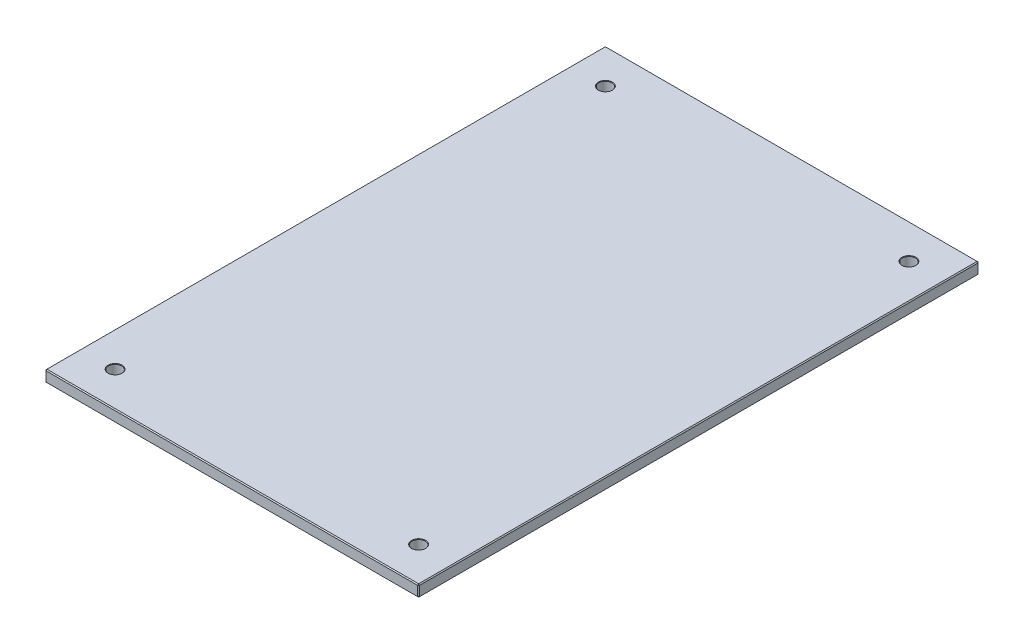
ISO-10303-21;
HEADER;
FILE_DESCRIPTION(('STEP AP214'),'2;1');
FILE_NAME('part.step','',(''),(''),'','','');
FILE_SCHEMA(('AUTOMOTIVE_DESIGN { 1 0 10303 214 1 1 1 1 }'));
ENDSEC;
DATA;
#1=APPLICATION_CONTEXT('core data for automotive mechanical design processes');
#2=APPLICATION_PROTOCOL_DEFINITION('international standard','automotive_design',2000,#1);
#3=PRODUCT_CONTEXT('',#1,'mechanical');
#4=PRODUCT('Part','Part','',(#3));
#5=PRODUCT_RELATED_PRODUCT_CATEGORY('part','',(#4));
#6=PRODUCT_DEFINITION_FORMATION('','',#4);
#7=PRODUCT_DEFINITION_CONTEXT('part definition',#1,'design');
#8=PRODUCT_DEFINITION('design','',#6,#7);
#9=PRODUCT_DEFINITION_SHAPE('','',#8);
#10=(LENGTH_UNIT() NAMED_UNIT(*) SI_UNIT(.MILLI.,.METRE.));
#11=(NAMED_UNIT(*) PLANE_ANGLE_UNIT() SI_UNIT($,.RADIAN.));
#12=(NAMED_UNIT(*) SI_UNIT($,.STERADIAN.) SOLID_ANGLE_UNIT());
#13=UNCERTAINTY_MEASURE_WITH_UNIT(LENGTH_MEASURE(1.E-05),#10,'distance_accuracy_value','');
#14=(GEOMETRIC_REPRESENTATION_CONTEXT(3) GLOBAL_UNCERTAINTY_ASSIGNED_CONTEXT((#13)) GLOBAL_UNIT_ASSIGNED_CONTEXT((#10,
#11,#12)) REPRESENTATION_CONTEXT('',''));
#15=CARTESIAN_POINT('',(0.,0.,0.));
#16=DIRECTION('',(0.,0.,1.));
#17=DIRECTION('',(1.,0.,0.));
#18=AXIS2_PLACEMENT_3D('',#15,#16,#17);
#19=CARTESIAN_POINT('',(101.6,3.175,152.4));
#20=DIRECTION('',(-1.,0.,0.));
#21=DIRECTION('',(0.,0.,1.));
#22=AXIS2_PLACEMENT_3D('',#19,#20,#21);
#23=PLANE('',#22);
#24=DIRECTION('',(0.,0.,-1.));
#25=VECTOR('',#24,1.);
#26=CARTESIAN_POINT('',(101.6,-2.66699999999999,-152.4));
#27=LINE('',#26,#25);
#28=CARTESIAN_POINT('',(101.6,-2.66699999999999,151.892));
#29=VERTEX_POINT('',#28);
#30=CARTESIAN_POINT('',(101.6,-2.66699999999999,-151.892));
#31=VERTEX_POINT('',#30);
#32=EDGE_CURVE('E183',#29,#31,#27,.T.);
#33=ORIENTED_EDGE('',*,*,#32,.T.);
#34=DIRECTION('',(0.,1.,0.));
#35=VECTOR('',#34,1.);
#36=CARTESIAN_POINT('',(101.6,3.175,-151.892));
#37=LINE('',#36,#35);
#38=CARTESIAN_POINT('',(101.6,2.66699999999999,-151.892));
#39=VERTEX_POINT('',#38);
#40=EDGE_CURVE('E188',#31,#39,#37,.T.);
#41=ORIENTED_EDGE('',*,*,#40,.T.);
#42=DIRECTION('',(0.,0.,1.));
#43=VECTOR('',#42,1.);
#44=CARTESIAN_POINT('',(101.6,2.66699999999999,152.4));
#45=LINE('',#44,#43);
#46=CARTESIAN_POINT('',(101.6,2.66699999999999,151.892));
#47=VERTEX_POINT('',#46);
#48=EDGE_CURVE('E185',#39,#47,#45,.T.);
#49=ORIENTED_EDGE('',*,*,#48,.T.);
#50=DIRECTION('',(0.,-1.,0.));
#51=VECTOR('',#50,1.);
#52=CARTESIAN_POINT('',(101.6,3.175,151.892));
#53=LINE('',#52,#51);
#54=EDGE_CURVE('E181',#47,#29,#53,.T.);
#55=ORIENTED_EDGE('',*,*,#54,.T.);
#56=EDGE_LOOP('',(#33,#41,#49,#55));
#57=FACE_BOUND('',#56,.T.);
#58=ADVANCED_FACE('F46',(#57),#23,.F.);
#59=CARTESIAN_POINT('',(-101.6,3.175,-152.4));
#60=DIRECTION('',(0.,0.,1.));
#61=DIRECTION('',(1.,0.,0.));
#62=AXIS2_PLACEMENT_3D('',#59,#60,#61);
#63=PLANE('',#62);
#64=DIRECTION('',(1.,0.,0.));
#65=VECTOR('',#64,1.);
#66=CARTESIAN_POINT('',(-101.6,2.66699999999999,-152.4));
#67=LINE('',#66,#65);
#68=CARTESIAN_POINT('',(-101.092,2.66699999999999,-152.4));
#69=VERTEX_POINT('',#68);
#70=CARTESIAN_POINT('',(101.092,2.66699999999999,-152.4));
#71=VERTEX_POINT('',#70);
#72=EDGE_CURVE('E203',#69,#71,#67,.T.);
#73=ORIENTED_EDGE('',*,*,#72,.T.);
#74=DIRECTION('',(0.,-1.,0.));
#75=VECTOR('',#74,1.);
#76=CARTESIAN_POINT('',(101.092,3.175,-152.4));
#77=LINE('',#76,#75);
#78=CARTESIAN_POINT('',(101.092,-2.66699999999999,-152.4));
#79=VERTEX_POINT('',#78);
#80=EDGE_CURVE('E205',#71,#79,#77,.T.);
#81=ORIENTED_EDGE('',*,*,#80,.T.);
#82=DIRECTION('',(-1.,0.,0.));
#83=VECTOR('',#82,1.);
#84=CARTESIAN_POINT('',(-101.6,-2.66699999999999,-152.4));
#85=LINE('',#84,#83);
#86=CARTESIAN_POINT('',(-101.092,-2.66699999999999,-152.4));
#87=VERTEX_POINT('',#86);
#88=EDGE_CURVE('E201',#79,#87,#85,.T.);
#89=ORIENTED_EDGE('',*,*,#88,.T.);
#90=DIRECTION('',(0.,1.,0.));
#91=VECTOR('',#90,1.);
#92=CARTESIAN_POINT('',(-101.092,3.175,-152.4));
#93=LINE('',#92,#91);
#94=EDGE_CURVE('E199',#87,#69,#93,.T.);
#95=ORIENTED_EDGE('',*,*,#94,.T.);
#96=EDGE_LOOP('',(#73,#81,#89,#95));
#97=FACE_BOUND('',#96,.T.);
#98=ADVANCED_FACE('F349',(#97),#63,.F.);
#99=CARTESIAN_POINT('',(-101.6,3.175,152.4));
#100=DIRECTION('',(1.,0.,0.));
#101=DIRECTION('',(0.,0.,-1.));
#102=AXIS2_PLACEMENT_3D('',#99,#100,#101);
#103=PLANE('',#102);
#104=DIRECTION('',(0.,0.,-1.));
#105=VECTOR('',#104,1.);
#106=CARTESIAN_POINT('',(-101.6,2.66699999999999,152.4));
#107=LINE('',#106,#105);
#108=CARTESIAN_POINT('',(-101.6,2.66699999999999,151.892));
#109=VERTEX_POINT('',#108);
#110=CARTESIAN_POINT('',(-101.6,2.66699999999999,-151.892));
#111=VERTEX_POINT('',#110);
#112=EDGE_CURVE('E153',#109,#111,#107,.T.);
#113=ORIENTED_EDGE('',*,*,#112,.T.);
#114=DIRECTION('',(0.,-1.,0.));
#115=VECTOR('',#114,1.);
#116=CARTESIAN_POINT('',(-101.6,3.175,-151.892));
#117=LINE('',#116,#115);
#118=CARTESIAN_POINT('',(-101.6,-2.66699999999999,-151.892));
#119=VERTEX_POINT('',#118);
#120=EDGE_CURVE('E213',#111,#119,#117,.T.);
#121=ORIENTED_EDGE('',*,*,#120,.T.);
#122=DIRECTION('',(0.,0.,1.));
#123=VECTOR('',#122,1.);
#124=CARTESIAN_POINT('',(-101.6,-2.66699999999999,152.4));
#125=LINE('',#124,#123);
#126=CARTESIAN_POINT('',(-101.6,-2.66699999999999,151.892));
#127=VERTEX_POINT('',#126);
#128=EDGE_CURVE('E210',#119,#127,#125,.T.);
#129=ORIENTED_EDGE('',*,*,#128,.T.);
#130=DIRECTION('',(0.,1.,0.));
#131=VECTOR('',#130,1.);
#132=CARTESIAN_POINT('',(-101.6,3.175,151.892));
#133=LINE('',#132,#131);
#134=EDGE_CURVE('E208',#127,#109,#133,.T.);
#135=ORIENTED_EDGE('',*,*,#134,.T.);
#136=EDGE_LOOP('',(#113,#121,#129,#135));
#137=FACE_BOUND('',#136,.T.);
#138=ADVANCED_FACE('F345',(#137),#103,.F.);
#139=CARTESIAN_POINT('',(-101.6,3.175,152.4));
#140=DIRECTION('',(0.,0.,-1.));
#141=DIRECTION('',(-1.,0.,0.));
#142=AXIS2_PLACEMENT_3D('',#139,#140,#141);
#143=PLANE('',#142);
#144=DIRECTION('',(-1.,0.,0.));
#145=VECTOR('',#144,1.);
#146=CARTESIAN_POINT('',(-101.6,2.66699999999999,152.4));
#147=LINE('',#146,#145);
#148=CARTESIAN_POINT('',(101.092,2.66699999999999,152.4));
#149=VERTEX_POINT('',#148);
#150=CARTESIAN_POINT('',(-101.092,2.66699999999999,152.4));
#151=VERTEX_POINT('',#150);
#152=EDGE_CURVE('E56',#149,#151,#147,.T.);
#153=ORIENTED_EDGE('',*,*,#152,.T.);
#154=DIRECTION('',(0.,-1.,0.));
#155=VECTOR('',#154,1.);
#156=CARTESIAN_POINT('',(-101.092,3.175,152.4));
#157=LINE('',#156,#155);
#158=CARTESIAN_POINT('',(-101.092,-2.66699999999999,152.4));
#159=VERTEX_POINT('',#158);
#160=EDGE_CURVE('E11',#151,#159,#157,.T.);
#161=ORIENTED_EDGE('',*,*,#160,.T.);
#162=DIRECTION('',(1.,0.,0.));
#163=VECTOR('',#162,1.);
#164=CARTESIAN_POINT('',(101.6,-2.66699999999999,152.4));
#165=LINE('',#164,#163);
#166=CARTESIAN_POINT('',(101.092,-2.66699999999999,152.4));
#167=VERTEX_POINT('',#166);
#168=EDGE_CURVE('E216',#159,#167,#165,.T.);
#169=ORIENTED_EDGE('',*,*,#168,.T.);
#170=DIRECTION('',(0.,1.,0.));
#171=VECTOR('',#170,1.);
#172=CARTESIAN_POINT('',(101.092,3.175,152.4));
#173=LINE('',#172,#171);
#174=EDGE_CURVE('E67',#167,#149,#173,.T.);
#175=ORIENTED_EDGE('',*,*,#174,.T.);
#176=EDGE_LOOP('',(#153,#161,#169,#175));
#177=FACE_BOUND('',#176,.T.);
#178=ADVANCED_FACE('F336',(#177),#143,.F.);
#179=CARTESIAN_POINT('',(0.,3.175,0.));
#180=DIRECTION('',(0.,-1.,0.));
#181=DIRECTION('',(0.,0.,-1.));
#182=AXIS2_PLACEMENT_3D('',#179,#180,#181);
#183=PLANE('',#182);
#184=DIRECTION('',(1.,0.,0.));
#185=VECTOR('',#184,1.);
#186=CARTESIAN_POINT('',(0.,3.175,151.892));
#187=LINE('',#186,#185);
#188=CARTESIAN_POINT('',(-101.092,3.175,151.892));
#189=VERTEX_POINT('',#188);
#190=CARTESIAN_POINT('',(101.092,3.175,151.892));
#191=VERTEX_POINT('',#190);
#192=EDGE_CURVE('E140',#189,#191,#187,.T.);
#193=ORIENTED_EDGE('',*,*,#192,.T.);
#194=DIRECTION('',(0.,0.,-1.));
#195=VECTOR('',#194,1.);
#196=CARTESIAN_POINT('',(101.092,3.175,0.));
#197=LINE('',#196,#195);
#198=CARTESIAN_POINT('',(101.092,3.175,-151.892));
#199=VERTEX_POINT('',#198);
#200=EDGE_CURVE('E179',#191,#199,#197,.T.);
#201=ORIENTED_EDGE('',*,*,#200,.T.);
#202=DIRECTION('',(-1.,0.,0.));
#203=VECTOR('',#202,1.);
#204=CARTESIAN_POINT('',(0.,3.175,-151.892));
#205=LINE('',#204,#203);
#206=CARTESIAN_POINT('',(-101.092,3.175,-151.892));
#207=VERTEX_POINT('',#206);
#208=EDGE_CURVE('E143',#199,#207,#205,.T.);
#209=ORIENTED_EDGE('',*,*,#208,.T.);
#210=DIRECTION('',(0.,0.,1.));
#211=VECTOR('',#210,1.);
#212=CARTESIAN_POINT('',(-101.092,3.175,0.));
#213=LINE('',#212,#211);
#214=EDGE_CURVE('E134',#207,#189,#213,.T.);
#215=ORIENTED_EDGE('',*,*,#214,.T.);
#216=EDGE_LOOP('',(#193,#201,#209,#215));
#217=FACE_BOUND('',#216,.T.);
#218=CARTESIAN_POINT('',(-82.55,3.175,-133.35));
#219=DIRECTION('',(0.,1.,0.));
#220=DIRECTION('',(0.,0.,1.));
#221=AXIS2_PLACEMENT_3D('',#218,#219,#220);
#222=CIRCLE('',#221,3.82523999999999);
#223=CARTESIAN_POINT('',(-82.55,3.175,-129.52476));
#224=VERTEX_POINT('',#223);
#225=EDGE_CURVE('E280',#224,#224,#222,.T.);
#226=ORIENTED_EDGE('',*,*,#225,.F.);
#227=EDGE_LOOP('',(#226));
#228=FACE_BOUND('',#227,.T.);
#229=CARTESIAN_POINT('',(82.55,3.175,-133.35));
#230=DIRECTION('',(0.,1.,0.));
#231=DIRECTION('',(0.,0.,1.));
#232=AXIS2_PLACEMENT_3D('',#229,#230,#231);
#233=CIRCLE('',#232,3.82523999999999);
#234=CARTESIAN_POINT('',(82.55,3.175,-129.52476));
#235=VERTEX_POINT('',#234);
#236=EDGE_CURVE('E296',#235,#235,#233,.T.);
#237=ORIENTED_EDGE('',*,*,#236,.F.);
#238=EDGE_LOOP('',(#237));
#239=FACE_BOUND('',#238,.T.);
#240=CARTESIAN_POINT('',(82.55,3.175,133.35));
#241=DIRECTION('',(0.,1.,0.));
#242=DIRECTION('',(0.,0.,1.));
#243=AXIS2_PLACEMENT_3D('',#240,#241,#242);
#244=CIRCLE('',#243,3.82523999999999);
#245=CARTESIAN_POINT('',(82.55,3.175,137.17524));
#246=VERTEX_POINT('',#245);
#247=EDGE_CURVE('E308',#246,#246,#244,.T.);
#248=ORIENTED_EDGE('',*,*,#247,.F.);
#249=EDGE_LOOP('',(#248));
#250=FACE_BOUND('',#249,.T.);
#251=CARTESIAN_POINT('',(-82.55,3.175,133.35));
#252=DIRECTION('',(0.,1.,0.));
#253=DIRECTION('',(0.,0.,1.));
#254=AXIS2_PLACEMENT_3D('',#251,#252,#253);
#255=CIRCLE('',#254,3.82523999999999);
#256=CARTESIAN_POINT('',(-82.55,3.175,137.17524));
#257=VERTEX_POINT('',#256);
#258=EDGE_CURVE('E320',#257,#257,#255,.T.);
#259=ORIENTED_EDGE('',*,*,#258,.F.);
#260=EDGE_LOOP('',(#259));
#261=FACE_BOUND('',#260,.T.);
#262=ADVANCED_FACE('F136',(#217,#228,#239,#250,#261),#183,.F.);
#263=CARTESIAN_POINT('',(0.,-3.175,0.));
#264=DIRECTION('',(0.,-1.,0.));
#265=DIRECTION('',(0.,0.,-1.));
#266=AXIS2_PLACEMENT_3D('',#263,#264,#265);
#267=PLANE('',#266);
#268=DIRECTION('',(1.,0.,0.));
#269=VECTOR('',#268,1.);
#270=CARTESIAN_POINT('',(101.6,-3.175,-151.892));
#271=LINE('',#270,#269);
#272=CARTESIAN_POINT('',(-101.092,-3.175,-151.892));
#273=VERTEX_POINT('',#272);
#274=CARTESIAN_POINT('',(101.092,-3.175,-151.892));
#275=VERTEX_POINT('',#274);
#276=EDGE_CURVE('E194',#273,#275,#271,.T.);
#277=ORIENTED_EDGE('',*,*,#276,.T.);
#278=DIRECTION('',(0.,0.,1.));
#279=VECTOR('',#278,1.);
#280=CARTESIAN_POINT('',(101.092,-3.175,152.4));
#281=LINE('',#280,#279);
#282=CARTESIAN_POINT('',(101.092,-3.175,151.892));
#283=VERTEX_POINT('',#282);
#284=EDGE_CURVE('E196',#275,#283,#281,.T.);
#285=ORIENTED_EDGE('',*,*,#284,.T.);
#286=DIRECTION('',(-1.,0.,0.));
#287=VECTOR('',#286,1.);
#288=CARTESIAN_POINT('',(-101.6,-3.175,151.892));
#289=LINE('',#288,#287);
#290=CARTESIAN_POINT('',(-101.092,-3.175,151.892));
#291=VERTEX_POINT('',#290);
#292=EDGE_CURVE('E190',#283,#291,#289,.T.);
#293=ORIENTED_EDGE('',*,*,#292,.T.);
#294=DIRECTION('',(0.,0.,-1.));
#295=VECTOR('',#294,1.);
#296=CARTESIAN_POINT('',(-101.092,-3.175,-152.4));
#297=LINE('',#296,#295);
#298=EDGE_CURVE('E192',#291,#273,#297,.T.);
#299=ORIENTED_EDGE('',*,*,#298,.T.);
#300=EDGE_LOOP('',(#277,#285,#293,#299));
#301=FACE_BOUND('',#300,.T.);
#302=CARTESIAN_POINT('',(-82.55,-3.175,-133.35));
#303=DIRECTION('',(0.,1.,0.));
#304=DIRECTION('',(0.,0.,1.));
#305=AXIS2_PLACEMENT_3D('',#302,#303,#304);
#306=CIRCLE('',#305,3.82523999999999);
#307=CARTESIAN_POINT('',(-82.55,-3.175,-129.52476));
#308=VERTEX_POINT('',#307);
#309=EDGE_CURVE('E274',#308,#308,#306,.T.);
#310=ORIENTED_EDGE('',*,*,#309,.T.);
#311=EDGE_LOOP('',(#310));
#312=FACE_BOUND('',#311,.T.);
#313=CARTESIAN_POINT('',(82.55,-3.175,-133.35));
#314=DIRECTION('',(0.,1.,0.));
#315=DIRECTION('',(0.,0.,1.));
#316=AXIS2_PLACEMENT_3D('',#313,#314,#315);
#317=CIRCLE('',#316,3.82523999999999);
#318=CARTESIAN_POINT('',(82.55,-3.175,-129.52476));
#319=VERTEX_POINT('',#318);
#320=EDGE_CURVE('E293',#319,#319,#317,.T.);
#321=ORIENTED_EDGE('',*,*,#320,.T.);
#322=EDGE_LOOP('',(#321));
#323=FACE_BOUND('',#322,.T.);
#324=CARTESIAN_POINT('',(82.55,-3.175,133.35));
#325=DIRECTION('',(0.,1.,0.));
#326=DIRECTION('',(0.,0.,1.));
#327=AXIS2_PLACEMENT_3D('',#324,#325,#326);
#328=CIRCLE('',#327,3.82523999999999);
#329=CARTESIAN_POINT('',(82.55,-3.175,137.17524));
#330=VERTEX_POINT('',#329);
#331=EDGE_CURVE('E305',#330,#330,#328,.T.);
#332=ORIENTED_EDGE('',*,*,#331,.T.);
#333=EDGE_LOOP('',(#332));
#334=FACE_BOUND('',#333,.T.);
#335=CARTESIAN_POINT('',(-82.55,-3.175,133.35));
#336=DIRECTION('',(0.,1.,0.));
#337=DIRECTION('',(0.,0.,1.));
#338=AXIS2_PLACEMENT_3D('',#335,#336,#337);
#339=CIRCLE('',#338,3.82523999999999);
#340=CARTESIAN_POINT('',(-82.55,-3.175,137.17524));
#341=VERTEX_POINT('',#340);
#342=EDGE_CURVE('E317',#341,#341,#339,.T.);
#343=ORIENTED_EDGE('',*,*,#342,.T.);
#344=EDGE_LOOP('',(#343));
#345=FACE_BOUND('',#344,.T.);
#346=ADVANCED_FACE('F335',(#301,#312,#323,#334,#345),#267,.T.);
#347=CARTESIAN_POINT('',(-82.55,-2.921,133.35));
#348=DIRECTION('',(0.,-1.,0.));
#349=DIRECTION('',(0.,0.,-1.));
#350=AXIS2_PLACEMENT_3D('',#347,#348,#349);
#351=CONICAL_SURFACE('',#350,3.57124,0.785398163397426);
#352=ORIENTED_EDGE('',*,*,#342,.F.);
#353=EDGE_LOOP('',(#352));
#354=FACE_BOUND('',#353,.T.);
#355=CARTESIAN_POINT('',(-82.55,-2.921,133.35));
#356=DIRECTION('',(0.,1.,0.));
#357=DIRECTION('',(0.,0.,1.));
#358=AXIS2_PLACEMENT_3D('',#355,#356,#357);
#359=CIRCLE('',#358,3.57124);
#360=CARTESIAN_POINT('',(-82.55,-2.921,136.92124));
#361=VERTEX_POINT('',#360);
#362=EDGE_CURVE('E171',#361,#361,#359,.T.);
#363=ORIENTED_EDGE('',*,*,#362,.T.);
#364=EDGE_LOOP('',(#363));
#365=FACE_BOUND('',#364,.T.);
#366=ADVANCED_FACE('F342',(#354,#365),#351,.F.);
#367=CARTESIAN_POINT('',(-82.55,3.175,133.35));
#368=DIRECTION('',(0.,1.,0.));
#369=DIRECTION('',(0.,0.,1.));
#370=AXIS2_PLACEMENT_3D('',#367,#368,#369);
#371=CYLINDRICAL_SURFACE('',#370,3.57124);
#372=ORIENTED_EDGE('',*,*,#362,.F.);
#373=EDGE_LOOP('',(#372));
#374=FACE_BOUND('',#373,.T.);
#375=CARTESIAN_POINT('',(-82.55,2.921,133.35));
#376=DIRECTION('',(0.,1.,0.));
#377=DIRECTION('',(0.,0.,1.));
#378=AXIS2_PLACEMENT_3D('',#375,#376,#377);
#379=CIRCLE('',#378,3.57124);
#380=CARTESIAN_POINT('',(-82.55,2.921,136.92124));
#381=VERTEX_POINT('',#380);
#382=EDGE_CURVE('E174',#381,#381,#379,.T.);
#383=ORIENTED_EDGE('',*,*,#382,.T.);
#384=EDGE_LOOP('',(#383));
#385=FACE_BOUND('',#384,.T.);
#386=ADVANCED_FACE('F325',(#374,#385),#371,.F.);
#387=CARTESIAN_POINT('',(-82.55,3.175,133.35));
#388=DIRECTION('',(0.,1.,0.));
#389=DIRECTION('',(0.,0.,1.));
#390=AXIS2_PLACEMENT_3D('',#387,#388,#389);
#391=CONICAL_SURFACE('',#390,3.82523999999999,0.785398163397428);
#392=ORIENTED_EDGE('',*,*,#382,.F.);
#393=EDGE_LOOP('',(#392));
#394=FACE_BOUND('',#393,.T.);
#395=ORIENTED_EDGE('',*,*,#258,.T.);
#396=EDGE_LOOP('',(#395));
#397=FACE_BOUND('',#396,.T.);
#398=ADVANCED_FACE('F327',(#394,#397),#391,.F.);
#399=CARTESIAN_POINT('',(82.55,-2.921,133.35));
#400=DIRECTION('',(0.,-1.,0.));
#401=DIRECTION('',(0.,0.,-1.));
#402=AXIS2_PLACEMENT_3D('',#399,#400,#401);
#403=CONICAL_SURFACE('',#402,3.57124,0.785398163397426);
#404=ORIENTED_EDGE('',*,*,#331,.F.);
#405=EDGE_LOOP('',(#404));
#406=FACE_BOUND('',#405,.T.);
#407=CARTESIAN_POINT('',(82.55,-2.921,133.35));
#408=DIRECTION('',(0.,1.,0.));
#409=DIRECTION('',(0.,0.,1.));
#410=AXIS2_PLACEMENT_3D('',#407,#408,#409);
#411=CIRCLE('',#410,3.57124);
#412=CARTESIAN_POINT('',(82.55,-2.921,136.92124));
#413=VERTEX_POINT('',#412);
#414=EDGE_CURVE('E314',#413,#413,#411,.T.);
#415=ORIENTED_EDGE('',*,*,#414,.T.);
#416=EDGE_LOOP('',(#415));
#417=FACE_BOUND('',#416,.T.);
#418=ADVANCED_FACE('F330',(#406,#417),#403,.F.);
#419=CARTESIAN_POINT('',(82.55,3.175,133.35));
#420=DIRECTION('',(0.,1.,0.));
#421=DIRECTION('',(0.,0.,1.));
#422=AXIS2_PLACEMENT_3D('',#419,#420,#421);
#423=CYLINDRICAL_SURFACE('',#422,3.57124);
#424=ORIENTED_EDGE('',*,*,#414,.F.);
#425=EDGE_LOOP('',(#424));
#426=FACE_BOUND('',#425,.T.);
#427=CARTESIAN_POINT('',(82.55,2.921,133.35));
#428=DIRECTION('',(0.,1.,0.));
#429=DIRECTION('',(0.,0.,1.));
#430=AXIS2_PLACEMENT_3D('',#427,#428,#429);
#431=CIRCLE('',#430,3.57124);
#432=CARTESIAN_POINT('',(82.55,2.921,136.92124));
#433=VERTEX_POINT('',#432);
#434=EDGE_CURVE('E311',#433,#433,#431,.T.);
#435=ORIENTED_EDGE('',*,*,#434,.T.);
#436=EDGE_LOOP('',(#435));
#437=FACE_BOUND('',#436,.T.);
#438=ADVANCED_FACE('F534',(#426,#437),#423,.F.);
#439=CARTESIAN_POINT('',(82.55,3.175,133.35));
#440=DIRECTION('',(0.,1.,0.));
#441=DIRECTION('',(0.,0.,1.));
#442=AXIS2_PLACEMENT_3D('',#439,#440,#441);
#443=CONICAL_SURFACE('',#442,3.82523999999999,0.785398163397428);
#444=ORIENTED_EDGE('',*,*,#434,.F.);
#445=EDGE_LOOP('',(#444));
#446=FACE_BOUND('',#445,.T.);
#447=ORIENTED_EDGE('',*,*,#247,.T.);
#448=EDGE_LOOP('',(#447));
#449=FACE_BOUND('',#448,.T.);
#450=ADVANCED_FACE('F538',(#446,#449),#443,.F.);
#451=CARTESIAN_POINT('',(82.55,-2.921,-133.35));
#452=DIRECTION('',(0.,-1.,0.));
#453=DIRECTION('',(0.,0.,-1.));
#454=AXIS2_PLACEMENT_3D('',#451,#452,#453);
#455=CONICAL_SURFACE('',#454,3.57124,0.785398163397426);
#456=ORIENTED_EDGE('',*,*,#320,.F.);
#457=EDGE_LOOP('',(#456));
#458=FACE_BOUND('',#457,.T.);
#459=CARTESIAN_POINT('',(82.55,-2.921,-133.35));
#460=DIRECTION('',(0.,1.,0.));
#461=DIRECTION('',(0.,0.,1.));
#462=AXIS2_PLACEMENT_3D('',#459,#460,#461);
#463=CIRCLE('',#462,3.57124);
#464=CARTESIAN_POINT('',(82.55,-2.921,-129.77876));
#465=VERTEX_POINT('',#464);
#466=EDGE_CURVE('E302',#465,#465,#463,.T.);
#467=ORIENTED_EDGE('',*,*,#466,.T.);
#468=EDGE_LOOP('',(#467));
#469=FACE_BOUND('',#468,.T.);
#470=ADVANCED_FACE('F542',(#458,#469),#455,.F.);
#471=CARTESIAN_POINT('',(82.55,3.175,-133.35));
#472=DIRECTION('',(0.,1.,0.));
#473=DIRECTION('',(0.,0.,1.));
#474=AXIS2_PLACEMENT_3D('',#471,#472,#473);
#475=CYLINDRICAL_SURFACE('',#474,3.57124);
#476=ORIENTED_EDGE('',*,*,#466,.F.);
#477=EDGE_LOOP('',(#476));
#478=FACE_BOUND('',#477,.T.);
#479=CARTESIAN_POINT('',(82.55,2.921,-133.35));
#480=DIRECTION('',(0.,1.,0.));
#481=DIRECTION('',(0.,0.,1.));
#482=AXIS2_PLACEMENT_3D('',#479,#480,#481);
#483=CIRCLE('',#482,3.57124);
#484=CARTESIAN_POINT('',(82.55,2.921,-129.77876));
#485=VERTEX_POINT('',#484);
#486=EDGE_CURVE('E299',#485,#485,#483,.T.);
#487=ORIENTED_EDGE('',*,*,#486,.T.);
#488=EDGE_LOOP('',(#487));
#489=FACE_BOUND('',#488,.T.);
#490=ADVANCED_FACE('F546',(#478,#489),#475,.F.);
#491=CARTESIAN_POINT('',(82.55,3.175,-133.35));
#492=DIRECTION('',(0.,1.,0.));
#493=DIRECTION('',(0.,0.,1.));
#494=AXIS2_PLACEMENT_3D('',#491,#492,#493);
#495=CONICAL_SURFACE('',#494,3.82523999999999,0.785398163397428);
#496=ORIENTED_EDGE('',*,*,#486,.F.);
#497=EDGE_LOOP('',(#496));
#498=FACE_BOUND('',#497,.T.);
#499=ORIENTED_EDGE('',*,*,#236,.T.);
#500=EDGE_LOOP('',(#499));
#501=FACE_BOUND('',#500,.T.);
#502=ADVANCED_FACE('F550',(#498,#501),#495,.F.);
#503=CARTESIAN_POINT('',(-82.55,-2.921,-133.35));
#504=DIRECTION('',(0.,-1.,0.));
#505=DIRECTION('',(0.,0.,-1.));
#506=AXIS2_PLACEMENT_3D('',#503,#504,#505);
#507=CONICAL_SURFACE('',#506,3.57124,0.785398163397426);
#508=ORIENTED_EDGE('',*,*,#309,.F.);
#509=EDGE_LOOP('',(#508));
#510=FACE_BOUND('',#509,.T.);
#511=CARTESIAN_POINT('',(-82.55,-2.921,-133.35));
#512=DIRECTION('',(0.,1.,0.));
#513=DIRECTION('',(0.,0.,1.));
#514=AXIS2_PLACEMENT_3D('',#511,#512,#513);
#515=CIRCLE('',#514,3.57124);
#516=CARTESIAN_POINT('',(-82.55,-2.921,-129.77876));
#517=VERTEX_POINT('',#516);
#518=EDGE_CURVE('E290',#517,#517,#515,.T.);
#519=ORIENTED_EDGE('',*,*,#518,.T.);
#520=EDGE_LOOP('',(#519));
#521=FACE_BOUND('',#520,.T.);
#522=ADVANCED_FACE('F554',(#510,#521),#507,.F.);
#523=CARTESIAN_POINT('',(-82.55,3.175,-133.35));
#524=DIRECTION('',(0.,1.,0.));
#525=DIRECTION('',(0.,0.,1.));
#526=AXIS2_PLACEMENT_3D('',#523,#524,#525);
#527=CYLINDRICAL_SURFACE('',#526,3.57124);
#528=ORIENTED_EDGE('',*,*,#518,.F.);
#529=EDGE_LOOP('',(#528));
#530=FACE_BOUND('',#529,.T.);
#531=CARTESIAN_POINT('',(-82.55,2.921,-133.35));
#532=DIRECTION('',(0.,1.,0.));
#533=DIRECTION('',(0.,0.,1.));
#534=AXIS2_PLACEMENT_3D('',#531,#532,#533);
#535=CIRCLE('',#534,3.57124);
#536=CARTESIAN_POINT('',(-82.55,2.921,-129.77876));
#537=VERTEX_POINT('',#536);
#538=EDGE_CURVE('E285',#537,#537,#535,.T.);
#539=ORIENTED_EDGE('',*,*,#538,.T.);
#540=EDGE_LOOP('',(#539));
#541=FACE_BOUND('',#540,.T.);
#542=ADVANCED_FACE('F558',(#530,#541),#527,.F.);
#543=CARTESIAN_POINT('',(-82.55,3.175,-133.35));
#544=DIRECTION('',(0.,1.,0.));
#545=DIRECTION('',(0.,0.,1.));
#546=AXIS2_PLACEMENT_3D('',#543,#544,#545);
#547=CONICAL_SURFACE('',#546,3.82523999999999,0.785398163397428);
#548=ORIENTED_EDGE('',*,*,#538,.F.);
#549=EDGE_LOOP('',(#548));
#550=FACE_BOUND('',#549,.T.);
#551=ORIENTED_EDGE('',*,*,#225,.T.);
#552=EDGE_LOOP('',(#551));
#553=FACE_BOUND('',#552,.T.);
#554=ADVANCED_FACE('F486',(#550,#553),#547,.F.);
#555=CARTESIAN_POINT('',(-101.6,-2.66699999999999,152.4));
#556=DIRECTION('',(-0.707106781186547,-0.707106781186547,0.));
#557=DIRECTION('',(0.,0.,-1.));
#558=AXIS2_PLACEMENT_3D('',#555,#556,#557);
#559=PLANE('',#558);
#560=DIRECTION('',(0.707106781186547,-0.707106781186547,0.));
#561=VECTOR('',#560,1.);
#562=CARTESIAN_POINT('',(-101.6,-2.66699999999999,151.892));
#563=LINE('',#562,#561);
#564=EDGE_CURVE('E51',#127,#291,#563,.T.);
#565=ORIENTED_EDGE('',*,*,#564,.F.);
#566=ORIENTED_EDGE('',*,*,#128,.F.);
#567=DIRECTION('',(-0.707106781186547,0.707106781186547,0.));
#568=VECTOR('',#567,1.);
#569=CARTESIAN_POINT('',(-101.346,-2.921,-151.892));
#570=LINE('',#569,#568);
#571=EDGE_CURVE('E266',#273,#119,#570,.T.);
#572=ORIENTED_EDGE('',*,*,#571,.F.);
#573=ORIENTED_EDGE('',*,*,#298,.F.);
#574=EDGE_LOOP('',(#565,#566,#572,#573));
#575=FACE_BOUND('',#574,.T.);
#576=ADVANCED_FACE('F49',(#575),#559,.T.);
#577=CARTESIAN_POINT('',(-101.6,-2.66699999999999,151.892));
#578=DIRECTION('',(-0.577350269189626,-0.577350269189626,0.577350269189626));
#579=DIRECTION('',(0.707106781186547,0.,0.707106781186547));
#580=AXIS2_PLACEMENT_3D('',#577,#578,#579);
#581=PLANE('',#580);
#582=DIRECTION('',(0.707106781186547,0.,0.707106781186547));
#583=VECTOR('',#582,1.);
#584=CARTESIAN_POINT('',(-101.6,-2.66699999999999,151.892));
#585=LINE('',#584,#583);
#586=EDGE_CURVE('E261',#127,#159,#585,.T.);
#587=ORIENTED_EDGE('',*,*,#586,.F.);
#588=ORIENTED_EDGE('',*,*,#564,.T.);
#589=DIRECTION('',(0.,0.707106781186547,0.707106781186547));
#590=VECTOR('',#589,1.);
#591=CARTESIAN_POINT('',(-101.092,-2.921,152.146));
#592=LINE('',#591,#590);
#593=EDGE_CURVE('E264',#159,#291,#592,.F.);
#594=ORIENTED_EDGE('',*,*,#593,.F.);
#595=EDGE_LOOP('',(#587,#588,#594));
#596=FACE_BOUND('',#595,.T.);
#597=ADVANCED_FACE('F479',(#596),#581,.T.);
#598=CARTESIAN_POINT('',(-101.092,-2.66699999999999,-152.4));
#599=DIRECTION('',(-0.577350269189626,-0.577350269189626,-0.577350269189626));
#600=DIRECTION('',(-0.707106781186547,0.,0.707106781186547));
#601=AXIS2_PLACEMENT_3D('',#598,#599,#600);
#602=PLANE('',#601);
#603=DIRECTION('',(0.,-0.707106781186547,0.707106781186547));
#604=VECTOR('',#603,1.);
#605=CARTESIAN_POINT('',(-101.092,-2.66699999999999,-152.4));
#606=LINE('',#605,#604);
#607=EDGE_CURVE('E256',#273,#87,#606,.F.);
#608=ORIENTED_EDGE('',*,*,#607,.F.);
#609=ORIENTED_EDGE('',*,*,#571,.T.);
#610=DIRECTION('',(-0.707106781186547,0.,0.707106781186547));
#611=VECTOR('',#610,1.);
#612=CARTESIAN_POINT('',(-101.092,-2.66699999999999,-152.4));
#613=LINE('',#612,#611);
#614=EDGE_CURVE('E259',#87,#119,#613,.T.);
#615=ORIENTED_EDGE('',*,*,#614,.F.);
#616=EDGE_LOOP('',(#608,#609,#615));
#617=FACE_BOUND('',#616,.T.);
#618=ADVANCED_FACE('F473',(#617),#602,.T.);
#619=CARTESIAN_POINT('',(-101.6,-2.66699999999999,152.4));
#620=DIRECTION('',(0.,-0.707106781186547,0.707106781186547));
#621=DIRECTION('',(-1.,0.,0.));
#622=AXIS2_PLACEMENT_3D('',#619,#620,#621);
#623=PLANE('',#622);
#624=ORIENTED_EDGE('',*,*,#593,.T.);
#625=ORIENTED_EDGE('',*,*,#292,.F.);
#626=DIRECTION('',(0.,-0.707106781186547,-0.707106781186547));
#627=VECTOR('',#626,1.);
#628=CARTESIAN_POINT('',(101.092,-3.175,151.892));
#629=LINE('',#628,#627);
#630=EDGE_CURVE('E251',#167,#283,#629,.T.);
#631=ORIENTED_EDGE('',*,*,#630,.F.);
#632=ORIENTED_EDGE('',*,*,#168,.F.);
#633=EDGE_LOOP('',(#624,#625,#631,#632));
#634=FACE_BOUND('',#633,.T.);
#635=ADVANCED_FACE('F466',(#634),#623,.T.);
#636=CARTESIAN_POINT('',(-101.092,3.175,152.4));
#637=DIRECTION('',(0.707106781186547,0.,-0.707106781186547));
#638=DIRECTION('',(0.,-1.,0.));
#639=AXIS2_PLACEMENT_3D('',#636,#637,#638);
#640=PLANE('',#639);
#641=ORIENTED_EDGE('',*,*,#586,.T.);
#642=ORIENTED_EDGE('',*,*,#160,.F.);
#643=DIRECTION('',(-0.707106781186547,0.,-0.707106781186547));
#644=VECTOR('',#643,1.);
#645=CARTESIAN_POINT('',(-101.346,2.66699999999999,152.146));
#646=LINE('',#645,#644);
#647=EDGE_CURVE('E157',#109,#151,#646,.F.);
#648=ORIENTED_EDGE('',*,*,#647,.F.);
#649=ORIENTED_EDGE('',*,*,#134,.F.);
#650=EDGE_LOOP('',(#641,#642,#648,#649));
#651=FACE_BOUND('',#650,.T.);
#652=ADVANCED_FACE('F460',(#651),#640,.F.);
#653=CARTESIAN_POINT('',(-101.092,3.175,0.));
#654=DIRECTION('',(0.707106781186547,-0.707106781186547,0.));
#655=DIRECTION('',(0.,0.,1.));
#656=AXIS2_PLACEMENT_3D('',#653,#654,#655);
#657=PLANE('',#656);
#658=DIRECTION('',(-0.707106781186547,-0.707106781186547,0.));
#659=VECTOR('',#658,1.);
#660=CARTESIAN_POINT('',(-101.092,3.175,-151.892));
#661=LINE('',#660,#659);
#662=EDGE_CURVE('E158',#111,#207,#661,.F.);
#663=ORIENTED_EDGE('',*,*,#662,.F.);
#664=ORIENTED_EDGE('',*,*,#112,.F.);
#665=DIRECTION('',(0.707106781186547,0.707106781186547,0.));
#666=VECTOR('',#665,1.);
#667=CARTESIAN_POINT('',(-101.092,3.175,151.892));
#668=LINE('',#667,#666);
#669=EDGE_CURVE('E150',#189,#109,#668,.F.);
#670=ORIENTED_EDGE('',*,*,#669,.F.);
#671=ORIENTED_EDGE('',*,*,#214,.F.);
#672=EDGE_LOOP('',(#663,#664,#670,#671));
#673=FACE_BOUND('',#672,.T.);
#674=ADVANCED_FACE('F152',(#673),#657,.F.);
#675=CARTESIAN_POINT('',(-101.6,3.175,-151.892));
#676=DIRECTION('',(0.707106781186547,0.,0.707106781186547));
#677=DIRECTION('',(0.,-1.,0.));
#678=AXIS2_PLACEMENT_3D('',#675,#676,#677);
#679=PLANE('',#678);
#680=ORIENTED_EDGE('',*,*,#614,.T.);
#681=ORIENTED_EDGE('',*,*,#120,.F.);
#682=DIRECTION('',(0.707106781186547,0.,-0.707106781186547));
#683=VECTOR('',#682,1.);
#684=CARTESIAN_POINT('',(-101.346,2.66699999999999,-152.146));
#685=LINE('',#684,#683);
#686=EDGE_CURVE('E246',#69,#111,#685,.F.);
#687=ORIENTED_EDGE('',*,*,#686,.F.);
#688=ORIENTED_EDGE('',*,*,#94,.F.);
#689=EDGE_LOOP('',(#680,#681,#687,#688));
#690=FACE_BOUND('',#689,.T.);
#691=ADVANCED_FACE('F447',(#690),#679,.F.);
#692=CARTESIAN_POINT('',(-101.6,-2.66699999999999,-152.4));
#693=DIRECTION('',(0.,-0.707106781186547,-0.707106781186547));
#694=DIRECTION('',(1.,0.,0.));
#695=AXIS2_PLACEMENT_3D('',#692,#693,#694);
#696=PLANE('',#695);
#697=ORIENTED_EDGE('',*,*,#607,.T.);
#698=ORIENTED_EDGE('',*,*,#88,.F.);
#699=DIRECTION('',(0.,0.707106781186547,-0.707106781186547));
#700=VECTOR('',#699,1.);
#701=CARTESIAN_POINT('',(101.092,-2.921,-152.146));
#702=LINE('',#701,#700);
#703=EDGE_CURVE('E243',#275,#79,#702,.T.);
#704=ORIENTED_EDGE('',*,*,#703,.F.);
#705=ORIENTED_EDGE('',*,*,#276,.F.);
#706=EDGE_LOOP('',(#697,#698,#704,#705));
#707=FACE_BOUND('',#706,.T.);
#708=ADVANCED_FACE('F440',(#707),#696,.T.);
#709=CARTESIAN_POINT('',(101.6,-2.66699999999999,152.4));
#710=DIRECTION('',(0.707106781186547,-0.707106781186547,0.));
#711=DIRECTION('',(0.,0.,1.));
#712=AXIS2_PLACEMENT_3D('',#709,#710,#711);
#713=PLANE('',#712);
#714=DIRECTION('',(0.707106781186547,0.707106781186547,0.));
#715=VECTOR('',#714,1.);
#716=CARTESIAN_POINT('',(101.092,-3.175,151.892));
#717=LINE('',#716,#715);
#718=EDGE_CURVE('E253',#283,#29,#717,.T.);
#719=ORIENTED_EDGE('',*,*,#718,.F.);
#720=ORIENTED_EDGE('',*,*,#284,.F.);
#721=DIRECTION('',(-0.707106781186547,-0.707106781186547,0.));
#722=VECTOR('',#721,1.);
#723=CARTESIAN_POINT('',(101.6,-2.66699999999999,-151.892));
#724=LINE('',#723,#722);
#725=EDGE_CURVE('E240',#31,#275,#724,.T.);
#726=ORIENTED_EDGE('',*,*,#725,.F.);
#727=ORIENTED_EDGE('',*,*,#32,.F.);
#728=EDGE_LOOP('',(#719,#720,#726,#727));
#729=FACE_BOUND('',#728,.T.);
#730=ADVANCED_FACE('F433',(#729),#713,.T.);
#731=CARTESIAN_POINT('',(101.092,-3.175,151.892));
#732=DIRECTION('',(0.577350269189626,-0.577350269189626,0.577350269189626));
#733=DIRECTION('',(0.707106781186547,0.,-0.707106781186547));
#734=AXIS2_PLACEMENT_3D('',#731,#732,#733);
#735=PLANE('',#734);
#736=ORIENTED_EDGE('',*,*,#630,.T.);
#737=ORIENTED_EDGE('',*,*,#718,.T.);
#738=DIRECTION('',(0.707106781186547,0.,-0.707106781186547));
#739=VECTOR('',#738,1.);
#740=CARTESIAN_POINT('',(101.346,-2.66699999999999,152.146));
#741=LINE('',#740,#739);
#742=EDGE_CURVE('E164',#167,#29,#741,.T.);
#743=ORIENTED_EDGE('',*,*,#742,.F.);
#744=EDGE_LOOP('',(#736,#737,#743));
#745=FACE_BOUND('',#744,.T.);
#746=ADVANCED_FACE('F427',(#745),#735,.T.);
#747=CARTESIAN_POINT('',(-101.092,3.175,151.892));
#748=DIRECTION('',(-0.577350269189626,0.577350269189626,0.577350269189626));
#749=DIRECTION('',(0.707106781186547,0.,0.707106781186547));
#750=AXIS2_PLACEMENT_3D('',#747,#748,#749);
#751=PLANE('',#750);
#752=ORIENTED_EDGE('',*,*,#669,.T.);
#753=ORIENTED_EDGE('',*,*,#647,.T.);
#754=DIRECTION('',(0.,-0.707106781186547,0.707106781186547));
#755=VECTOR('',#754,1.);
#756=CARTESIAN_POINT('',(-101.092,3.175,151.892));
#757=LINE('',#756,#755);
#758=EDGE_CURVE('E161',#189,#151,#757,.T.);
#759=ORIENTED_EDGE('',*,*,#758,.F.);
#760=EDGE_LOOP('',(#752,#753,#759));
#761=FACE_BOUND('',#760,.T.);
#762=ADVANCED_FACE('F162',(#761),#751,.T.);
#763=CARTESIAN_POINT('',(-101.092,3.175,-151.892));
#764=DIRECTION('',(-0.577350269189626,0.577350269189626,-0.577350269189626));
#765=DIRECTION('',(-0.707106781186547,0.,0.707106781186547));
#766=AXIS2_PLACEMENT_3D('',#763,#764,#765);
#767=PLANE('',#766);
#768=ORIENTED_EDGE('',*,*,#686,.T.);
#769=ORIENTED_EDGE('',*,*,#662,.T.);
#770=DIRECTION('',(0.,0.707106781186547,0.707106781186547));
#771=VECTOR('',#770,1.);
#772=CARTESIAN_POINT('',(-101.092,3.175,-151.892));
#773=LINE('',#772,#771);
#774=EDGE_CURVE('E165',#69,#207,#773,.T.);
#775=ORIENTED_EDGE('',*,*,#774,.F.);
#776=EDGE_LOOP('',(#768,#769,#775));
#777=FACE_BOUND('',#776,.T.);
#778=ADVANCED_FACE('F414',(#777),#767,.T.);
#779=CARTESIAN_POINT('',(101.6,-2.66699999999999,-151.892));
#780=DIRECTION('',(0.577350269189626,-0.577350269189626,-0.577350269189626));
#781=DIRECTION('',(-0.707106781186547,0.,-0.707106781186547));
#782=AXIS2_PLACEMENT_3D('',#779,#780,#781);
#783=PLANE('',#782);
#784=ORIENTED_EDGE('',*,*,#725,.T.);
#785=ORIENTED_EDGE('',*,*,#703,.T.);
#786=DIRECTION('',(-0.707106781186547,0.,-0.707106781186547));
#787=VECTOR('',#786,1.);
#788=CARTESIAN_POINT('',(101.6,-2.66699999999999,-151.892));
#789=LINE('',#788,#787);
#790=EDGE_CURVE('E234',#31,#79,#789,.T.);
#791=ORIENTED_EDGE('',*,*,#790,.F.);
#792=EDGE_LOOP('',(#784,#785,#791));
#793=FACE_BOUND('',#792,.T.);
#794=ADVANCED_FACE('F407',(#793),#783,.T.);
#795=CARTESIAN_POINT('',(101.6,3.175,151.892));
#796=DIRECTION('',(-0.707106781186547,0.,-0.707106781186547));
#797=DIRECTION('',(0.,-1.,0.));
#798=AXIS2_PLACEMENT_3D('',#795,#796,#797);
#799=PLANE('',#798);
#800=ORIENTED_EDGE('',*,*,#742,.T.);
#801=ORIENTED_EDGE('',*,*,#54,.F.);
#802=DIRECTION('',(-0.707106781186547,0.,0.707106781186547));
#803=VECTOR('',#802,1.);
#804=CARTESIAN_POINT('',(101.6,2.66699999999999,151.892));
#805=LINE('',#804,#803);
#806=EDGE_CURVE('E231',#149,#47,#805,.F.);
#807=ORIENTED_EDGE('',*,*,#806,.F.);
#808=ORIENTED_EDGE('',*,*,#174,.F.);
#809=EDGE_LOOP('',(#800,#801,#807,#808));
#810=FACE_BOUND('',#809,.T.);
#811=ADVANCED_FACE('F401',(#810),#799,.F.);
#812=CARTESIAN_POINT('',(0.,3.175,151.892));
#813=DIRECTION('',(0.,-0.707106781186547,-0.707106781186547));
#814=DIRECTION('',(1.,0.,0.));
#815=AXIS2_PLACEMENT_3D('',#812,#813,#814);
#816=PLANE('',#815);
#817=ORIENTED_EDGE('',*,*,#758,.T.);
#818=ORIENTED_EDGE('',*,*,#152,.F.);
#819=DIRECTION('',(0.,0.707106781186547,-0.707106781186547));
#820=VECTOR('',#819,1.);
#821=CARTESIAN_POINT('',(101.092,2.921,152.146));
#822=LINE('',#821,#820);
#823=EDGE_CURVE('E169',#191,#149,#822,.F.);
#824=ORIENTED_EDGE('',*,*,#823,.F.);
#825=ORIENTED_EDGE('',*,*,#192,.F.);
#826=EDGE_LOOP('',(#817,#818,#824,#825));
#827=FACE_BOUND('',#826,.T.);
#828=ADVANCED_FACE('F167',(#827),#816,.F.);
#829=CARTESIAN_POINT('',(0.,3.175,-151.892));
#830=DIRECTION('',(0.,-0.707106781186547,0.707106781186547));
#831=DIRECTION('',(-1.,0.,0.));
#832=AXIS2_PLACEMENT_3D('',#829,#830,#831);
#833=PLANE('',#832);
#834=ORIENTED_EDGE('',*,*,#774,.T.);
#835=ORIENTED_EDGE('',*,*,#208,.F.);
#836=DIRECTION('',(0.,-0.707106781186547,-0.707106781186547));
#837=VECTOR('',#836,1.);
#838=CARTESIAN_POINT('',(101.092,3.175,-151.892));
#839=LINE('',#838,#837);
#840=EDGE_CURVE('E227',#71,#199,#839,.F.);
#841=ORIENTED_EDGE('',*,*,#840,.F.);
#842=ORIENTED_EDGE('',*,*,#72,.F.);
#843=EDGE_LOOP('',(#834,#835,#841,#842));
#844=FACE_BOUND('',#843,.T.);
#845=ADVANCED_FACE('F388',(#844),#833,.F.);
#846=CARTESIAN_POINT('',(101.092,3.175,-152.4));
#847=DIRECTION('',(-0.707106781186547,0.,0.707106781186547));
#848=DIRECTION('',(0.,-1.,0.));
#849=AXIS2_PLACEMENT_3D('',#846,#847,#848);
#850=PLANE('',#849);
#851=ORIENTED_EDGE('',*,*,#790,.T.);
#852=ORIENTED_EDGE('',*,*,#80,.F.);
#853=DIRECTION('',(0.707106781186547,0.,0.707106781186547));
#854=VECTOR('',#853,1.);
#855=CARTESIAN_POINT('',(101.346,2.66699999999999,-152.146));
#856=LINE('',#855,#854);
#857=EDGE_CURVE('E224',#39,#71,#856,.F.);
#858=ORIENTED_EDGE('',*,*,#857,.F.);
#859=ORIENTED_EDGE('',*,*,#40,.F.);
#860=EDGE_LOOP('',(#851,#852,#858,#859));
#861=FACE_BOUND('',#860,.T.);
#862=ADVANCED_FACE('F381',(#861),#850,.F.);
#863=CARTESIAN_POINT('',(101.6,2.66699999999999,151.892));
#864=DIRECTION('',(0.577350269189626,0.577350269189626,0.577350269189626));
#865=DIRECTION('',(0.707106781186547,0.,-0.707106781186547));
#866=AXIS2_PLACEMENT_3D('',#863,#864,#865);
#867=PLANE('',#866);
#868=ORIENTED_EDGE('',*,*,#823,.T.);
#869=ORIENTED_EDGE('',*,*,#806,.T.);
#870=DIRECTION('',(0.707106781186547,-0.707106781186547,0.));
#871=VECTOR('',#870,1.);
#872=CARTESIAN_POINT('',(101.6,2.66699999999999,151.892));
#873=LINE('',#872,#871);
#874=EDGE_CURVE('E222',#191,#47,#873,.T.);
#875=ORIENTED_EDGE('',*,*,#874,.F.);
#876=EDGE_LOOP('',(#868,#869,#875));
#877=FACE_BOUND('',#876,.T.);
#878=ADVANCED_FACE('F374',(#877),#867,.T.);
#879=CARTESIAN_POINT('',(101.092,3.175,-151.892));
#880=DIRECTION('',(0.577350269189626,0.577350269189626,-0.577350269189626));
#881=DIRECTION('',(-0.707106781186547,0.,-0.707106781186547));
#882=AXIS2_PLACEMENT_3D('',#879,#880,#881);
#883=PLANE('',#882);
#884=ORIENTED_EDGE('',*,*,#857,.T.);
#885=ORIENTED_EDGE('',*,*,#840,.T.);
#886=DIRECTION('',(-0.707106781186547,0.707106781186547,0.));
#887=VECTOR('',#886,1.);
#888=CARTESIAN_POINT('',(101.092,3.175,-151.892));
#889=LINE('',#888,#887);
#890=EDGE_CURVE('E220',#39,#199,#889,.T.);
#891=ORIENTED_EDGE('',*,*,#890,.F.);
#892=EDGE_LOOP('',(#884,#885,#891));
#893=FACE_BOUND('',#892,.T.);
#894=ADVANCED_FACE('F367',(#893),#883,.T.);
#895=CARTESIAN_POINT('',(101.092,3.175,0.));
#896=DIRECTION('',(-0.707106781186547,-0.707106781186547,0.));
#897=DIRECTION('',(0.,0.,-1.));
#898=AXIS2_PLACEMENT_3D('',#895,#896,#897);
#899=PLANE('',#898);
#900=ORIENTED_EDGE('',*,*,#874,.T.);
#901=ORIENTED_EDGE('',*,*,#48,.F.);
#902=ORIENTED_EDGE('',*,*,#890,.T.);
#903=ORIENTED_EDGE('',*,*,#200,.F.);
#904=EDGE_LOOP('',(#900,#901,#902,#903));
#905=FACE_BOUND('',#904,.T.);
#906=ADVANCED_FACE('F361',(#905),#899,.F.);
#907=CLOSED_SHELL('',(#58,#98,#138,#178,#262,#346,#366,#386,#398,#418,#438,#450,#470,#490,#502,
#522,#542,#554,#576,#597,#618,#635,#652,#674,#691,#708,#730,#746,#762,#778,#794,#811,#828,#845,
#862,#878,#894,#906));
#908=MANIFOLD_SOLID_BREP('B2',#907);
#909=ADVANCED_BREP_SHAPE_REPRESENTATION('',(#18,#908),#14);
#910=SHAPE_DEFINITION_REPRESENTATION(#9,#909);
ENDSEC;
END-ISO-10303-21;
